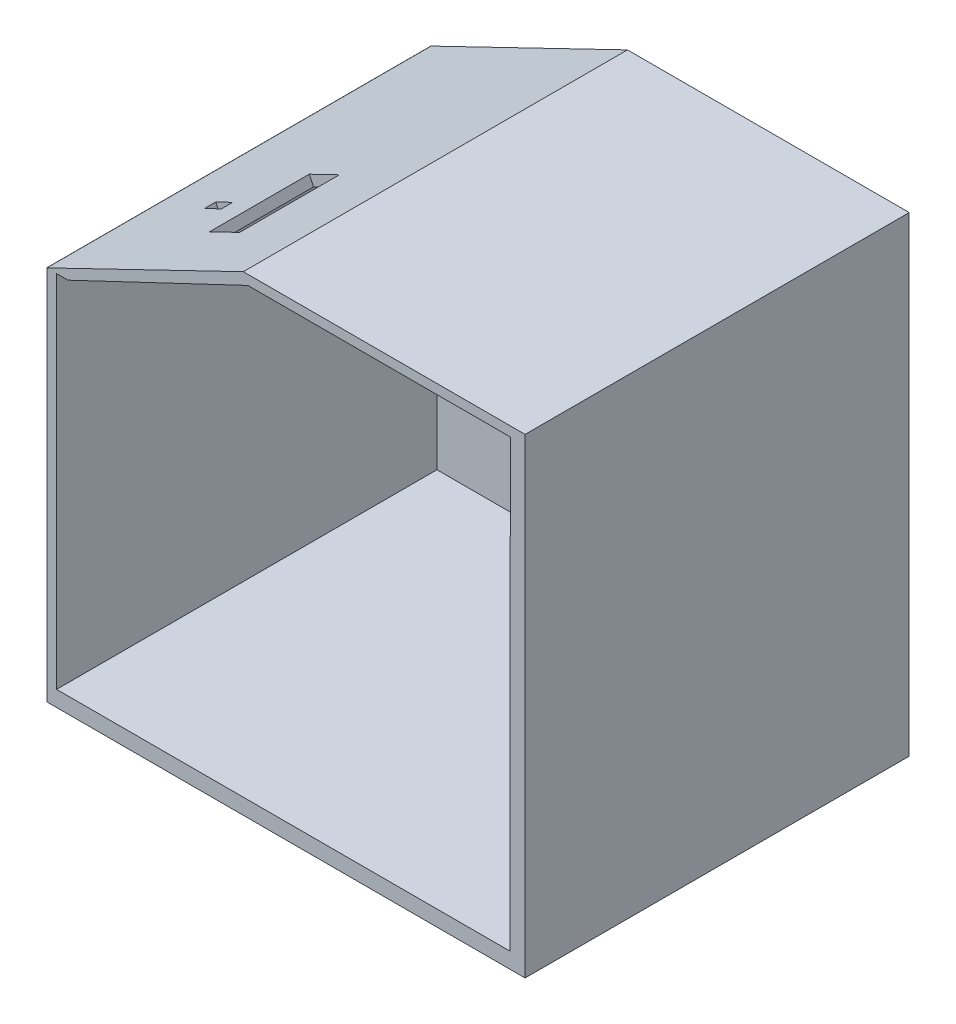
ISO-10303-21;
HEADER;
FILE_DESCRIPTION(('STEP AP214'),'2;1');
FILE_NAME('part.step','',(''),(''),'','','');
FILE_SCHEMA(('AUTOMOTIVE_DESIGN { 1 0 10303 214 1 1 1 1 }'));
ENDSEC;
DATA;
#1=APPLICATION_CONTEXT('core data for automotive mechanical design processes');
#2=APPLICATION_PROTOCOL_DEFINITION('international standard','automotive_design',2000,#1);
#3=PRODUCT_CONTEXT('',#1,'mechanical');
#4=PRODUCT('Part','Part','',(#3));
#5=PRODUCT_RELATED_PRODUCT_CATEGORY('part','',(#4));
#6=PRODUCT_DEFINITION_FORMATION('','',#4);
#7=PRODUCT_DEFINITION_CONTEXT('part definition',#1,'design');
#8=PRODUCT_DEFINITION('design','',#6,#7);
#9=PRODUCT_DEFINITION_SHAPE('','',#8);
#10=(LENGTH_UNIT() NAMED_UNIT(*) SI_UNIT(.MILLI.,.METRE.));
#11=(NAMED_UNIT(*) PLANE_ANGLE_UNIT() SI_UNIT($,.RADIAN.));
#12=(NAMED_UNIT(*) SI_UNIT($,.STERADIAN.) SOLID_ANGLE_UNIT());
#13=UNCERTAINTY_MEASURE_WITH_UNIT(LENGTH_MEASURE(1.E-05),#10,'distance_accuracy_value','');
#14=(GEOMETRIC_REPRESENTATION_CONTEXT(3) GLOBAL_UNCERTAINTY_ASSIGNED_CONTEXT((#13)) GLOBAL_UNIT_ASSIGNED_CONTEXT((#10,
#11,#12)) REPRESENTATION_CONTEXT('',''));
#15=CARTESIAN_POINT('',(0.,0.,0.));
#16=DIRECTION('',(0.,0.,1.));
#17=DIRECTION('',(1.,0.,0.));
#18=AXIS2_PLACEMENT_3D('',#15,#16,#17);
#19=CARTESIAN_POINT('',(253.882594532616,500.,204.781547842414));
#20=DIRECTION('',(0.,0.,-1.));
#21=DIRECTION('',(-1.,0.,0.));
#22=AXIS2_PLACEMENT_3D('',#19,#20,#21);
#23=PLANE('',#22);
#24=DIRECTION('',(1.,0.,0.));
#25=VECTOR('',#24,1.);
#26=CARTESIAN_POINT('',(253.882594532616,399.203948511765,204.781547842414));
#27=LINE('',#26,#25);
#28=CARTESIAN_POINT('',(-254.117405467384,399.203948511765,204.781547842414));
#29=VERTEX_POINT('',#28);
#30=CARTESIAN_POINT('',(-253.994172887688,399.203948511765,204.781547842414));
#31=VERTEX_POINT('',#30);
#32=EDGE_CURVE('E509',#29,#31,#27,.T.);
#33=ORIENTED_EDGE('',*,*,#32,.F.);
#34=DIRECTION('',(0.,-1.,0.));
#35=VECTOR('',#34,1.);
#36=CARTESIAN_POINT('',(-254.117405467384,500.,204.781547842414));
#37=LINE('',#36,#35);
#38=CARTESIAN_POINT('',(-254.117405467384,0.,204.781547842414));
#39=VERTEX_POINT('',#38);
#40=EDGE_CURVE('E464',#29,#39,#37,.T.);
#41=ORIENTED_EDGE('',*,*,#40,.T.);
#42=DIRECTION('',(1.,0.,0.));
#43=VECTOR('',#42,1.);
#44=CARTESIAN_POINT('',(253.882594532616,0.,204.781547842414));
#45=LINE('',#44,#43);
#46=CARTESIAN_POINT('',(253.882594532616,0.,204.781547842414));
#47=VERTEX_POINT('',#46);
#48=EDGE_CURVE('E440',#39,#47,#45,.T.);
#49=ORIENTED_EDGE('',*,*,#48,.T.);
#50=DIRECTION('',(0.,-1.,0.));
#51=VECTOR('',#50,1.);
#52=CARTESIAN_POINT('',(253.882594532616,500.,204.781547842414));
#53=LINE('',#52,#51);
#54=CARTESIAN_POINT('',(253.882594532616,500.,204.781547842414));
#55=VERTEX_POINT('',#54);
#56=EDGE_CURVE('E447',#55,#47,#53,.T.);
#57=ORIENTED_EDGE('',*,*,#56,.F.);
#58=DIRECTION('',(1.,0.,0.));
#59=VECTOR('',#58,1.);
#60=CARTESIAN_POINT('',(253.882594532616,500.,204.781547842414));
#61=LINE('',#60,#59);
#62=CARTESIAN_POINT('',(-45.3903766597549,500.,204.781547842414));
#63=VERTEX_POINT('',#62);
#64=EDGE_CURVE('E444',#63,#55,#61,.T.);
#65=ORIENTED_EDGE('',*,*,#64,.F.);
#66=DIRECTION('',(-0.900398187624282,-0.435066780762342,0.));
#67=VECTOR('',#66,1.);
#68=CARTESIAN_POINT('',(197.235277684948,617.235200844444,204.781547842414));
#69=LINE('',#68,#67);
#70=EDGE_CURVE('E505',#63,#31,#69,.T.);
#71=ORIENTED_EDGE('',*,*,#70,.T.);
#72=EDGE_LOOP('',(#33,#41,#49,#57,#65,#71));
#73=FACE_BOUND('',#72,.T.);
#74=DIRECTION('',(-0.903383069003791,-0.42883450261994,0.));
#75=VECTOR('',#74,1.);
#76=CARTESIAN_POINT('',(203.693094298104,605.729236982134,204.781547842414));
#77=LINE('',#76,#75);
#78=CARTESIAN_POINT('',(-40.5878057062895,489.76948319966,204.781547842414));
#79=VERTEX_POINT('',#78);
#80=CARTESIAN_POINT('',(-231.625791255195,399.084056025647,204.781547842414));
#81=VERTEX_POINT('',#80);
#82=EDGE_CURVE('E357',#79,#81,#77,.T.);
#83=ORIENTED_EDGE('',*,*,#82,.F.);
#84=DIRECTION('',(-1.,0.,0.));
#85=VECTOR('',#84,1.);
#86=CARTESIAN_POINT('',(253.882594532616,489.76948319966,204.781547842414));
#87=LINE('',#86,#85);
#88=CARTESIAN_POINT('',(238.202409937256,489.76948319966,204.781547842414));
#89=VERTEX_POINT('',#88);
#90=EDGE_CURVE('E226',#89,#79,#87,.T.);
#91=ORIENTED_EDGE('',*,*,#90,.F.);
#92=DIRECTION('',(0.,-1.,0.));
#93=VECTOR('',#92,1.);
#94=CARTESIAN_POINT('',(238.202409937256,500.,204.781547842414));
#95=LINE('',#94,#93);
#96=CARTESIAN_POINT('',(238.202409937256,398.176984129749,204.781547842414));
#97=VERTEX_POINT('',#96);
#98=EDGE_CURVE('E513',#89,#97,#95,.T.);
#99=ORIENTED_EDGE('',*,*,#98,.T.);
#100=DIRECTION('',(-1.,0.,0.));
#101=VECTOR('',#100,1.);
#102=CARTESIAN_POINT('',(253.882594532616,398.176984129749,204.781547842414));
#103=LINE('',#102,#101);
#104=CARTESIAN_POINT('',(238.104414358673,398.176984129749,204.781547842414));
#105=VERTEX_POINT('',#104);
#106=EDGE_CURVE('E339',#97,#105,#103,.T.);
#107=ORIENTED_EDGE('',*,*,#106,.T.);
#108=DIRECTION('',(0.,-1.,0.));
#109=VECTOR('',#108,1.);
#110=CARTESIAN_POINT('',(238.104414358673,500.,204.781547842414));
#111=LINE('',#110,#109);
#112=CARTESIAN_POINT('',(238.104414358674,16.6737443865783,204.781547842414));
#113=VERTEX_POINT('',#112);
#114=EDGE_CURVE('E494',#105,#113,#111,.T.);
#115=ORIENTED_EDGE('',*,*,#114,.T.);
#116=DIRECTION('',(-1.,0.,0.));
#117=VECTOR('',#116,1.);
#118=CARTESIAN_POINT('',(253.882594532616,16.6737443865783,204.781547842414));
#119=LINE('',#118,#117);
#120=CARTESIAN_POINT('',(-243.683157093227,16.6737443865783,204.781547842414));
#121=VERTEX_POINT('',#120);
#122=EDGE_CURVE('E490',#113,#121,#119,.T.);
#123=ORIENTED_EDGE('',*,*,#122,.T.);
#124=DIRECTION('',(0.,1.,0.));
#125=VECTOR('',#124,1.);
#126=CARTESIAN_POINT('',(-243.683157093227,500.,204.781547842414));
#127=LINE('',#126,#125);
#128=CARTESIAN_POINT('',(-243.683157093227,399.084056025647,204.781547842414));
#129=VERTEX_POINT('',#128);
#130=EDGE_CURVE('E501',#121,#129,#127,.T.);
#131=ORIENTED_EDGE('',*,*,#130,.T.);
#132=DIRECTION('',(1.,0.,0.));
#133=VECTOR('',#132,1.);
#134=CARTESIAN_POINT('',(253.882594532616,399.084056025647,204.781547842414));
#135=LINE('',#134,#133);
#136=EDGE_CURVE('E497',#129,#81,#135,.T.);
#137=ORIENTED_EDGE('',*,*,#136,.T.);
#138=EDGE_LOOP('',(#83,#91,#99,#107,#115,#123,#131,#137));
#139=FACE_BOUND('',#138,.T.);
#140=ADVANCED_FACE('F45',(#73,#139),#23,.F.);
#141=CARTESIAN_POINT('',(-243.683157093227,399.084056025647,-199.218452157586));
#142=DIRECTION('',(0.,1.,0.));
#143=DIRECTION('',(0.,0.,1.));
#144=AXIS2_PLACEMENT_3D('',#141,#142,#143);
#145=PLANE('',#144);
#146=DIRECTION('',(0.,0.,1.));
#147=VECTOR('',#146,1.);
#148=CARTESIAN_POINT('',(-231.625791255195,399.084056025647,-199.218452157586));
#149=LINE('',#148,#147);
#150=CARTESIAN_POINT('',(-231.625791255195,399.084056025647,-199.218452157586));
#151=VERTEX_POINT('',#150);
#152=EDGE_CURVE('E335',#151,#81,#149,.T.);
#153=ORIENTED_EDGE('',*,*,#152,.T.);
#154=ORIENTED_EDGE('',*,*,#136,.F.);
#155=DIRECTION('',(0.,0.,1.));
#156=VECTOR('',#155,1.);
#157=CARTESIAN_POINT('',(-243.683157093227,399.084056025647,-199.218452157586));
#158=LINE('',#157,#156);
#159=CARTESIAN_POINT('',(-243.683157093227,399.084056025647,-199.218452157586));
#160=VERTEX_POINT('',#159);
#161=EDGE_CURVE('E393',#160,#129,#158,.T.);
#162=ORIENTED_EDGE('',*,*,#161,.F.);
#163=DIRECTION('',(-1.,0.,0.));
#164=VECTOR('',#163,1.);
#165=CARTESIAN_POINT('',(-243.683157093227,399.084056025647,-199.218452157586));
#166=LINE('',#165,#164);
#167=EDGE_CURVE('E389',#151,#160,#166,.T.);
#168=ORIENTED_EDGE('',*,*,#167,.F.);
#169=EDGE_LOOP('',(#153,#154,#162,#168));
#170=FACE_BOUND('',#169,.T.);
#171=ADVANCED_FACE('F567',(#170),#145,.F.);
#172=CARTESIAN_POINT('',(253.882594532616,500.,-203.218452157586));
#173=DIRECTION('',(0.,0.,1.));
#174=DIRECTION('',(1.,0.,0.));
#175=AXIS2_PLACEMENT_3D('',#172,#173,#174);
#176=PLANE('',#175);
#177=DIRECTION('',(-1.,0.,0.));
#178=VECTOR('',#177,1.);
#179=CARTESIAN_POINT('',(253.882594532616,399.203948511765,-203.218452157586));
#180=LINE('',#179,#178);
#181=CARTESIAN_POINT('',(-253.994172887688,399.203948511765,-203.218452157586));
#182=VERTEX_POINT('',#181);
#183=CARTESIAN_POINT('',(-254.117405467384,399.203948511765,-203.218452157586));
#184=VERTEX_POINT('',#183);
#185=EDGE_CURVE('E374',#182,#184,#180,.T.);
#186=ORIENTED_EDGE('',*,*,#185,.F.);
#187=DIRECTION('',(0.900398187624282,0.435066780762342,0.));
#188=VECTOR('',#187,1.);
#189=CARTESIAN_POINT('',(197.235277684948,617.235200844444,-203.218452157586));
#190=LINE('',#189,#188);
#191=CARTESIAN_POINT('',(-45.3903766597549,500.,-203.218452157586));
#192=VERTEX_POINT('',#191);
#193=EDGE_CURVE('E364',#182,#192,#190,.T.);
#194=ORIENTED_EDGE('',*,*,#193,.T.);
#195=DIRECTION('',(-1.,0.,0.));
#196=VECTOR('',#195,1.);
#197=CARTESIAN_POINT('',(253.882594532616,500.,-203.218452157586));
#198=LINE('',#197,#196);
#199=CARTESIAN_POINT('',(253.882594532616,500.,-203.218452157586));
#200=VERTEX_POINT('',#199);
#201=EDGE_CURVE('E439',#200,#192,#198,.T.);
#202=ORIENTED_EDGE('',*,*,#201,.F.);
#203=DIRECTION('',(0.,-1.,0.));
#204=VECTOR('',#203,1.);
#205=CARTESIAN_POINT('',(253.882594532616,500.,-203.218452157586));
#206=LINE('',#205,#204);
#207=CARTESIAN_POINT('',(253.882594532616,0.,-203.218452157586));
#208=VERTEX_POINT('',#207);
#209=EDGE_CURVE('E470',#200,#208,#206,.T.);
#210=ORIENTED_EDGE('',*,*,#209,.T.);
#211=DIRECTION('',(-1.,0.,0.));
#212=VECTOR('',#211,1.);
#213=CARTESIAN_POINT('',(253.882594532616,0.,-203.218452157586));
#214=LINE('',#213,#212);
#215=CARTESIAN_POINT('',(-254.117405467384,0.,-203.218452157586));
#216=VERTEX_POINT('',#215);
#217=EDGE_CURVE('E451',#208,#216,#214,.T.);
#218=ORIENTED_EDGE('',*,*,#217,.T.);
#219=DIRECTION('',(0.,-1.,0.));
#220=VECTOR('',#219,1.);
#221=CARTESIAN_POINT('',(-254.117405467384,500.,-203.218452157586));
#222=LINE('',#221,#220);
#223=EDGE_CURVE('E467',#184,#216,#222,.T.);
#224=ORIENTED_EDGE('',*,*,#223,.F.);
#225=EDGE_LOOP('',(#186,#194,#202,#210,#218,#224));
#226=FACE_BOUND('',#225,.T.);
#227=ADVANCED_FACE('F547',(#226),#176,.F.);
#228=CARTESIAN_POINT('',(-254.117405467384,500.,-203.218452157586));
#229=DIRECTION('',(1.,0.,0.));
#230=DIRECTION('',(0.,0.,-1.));
#231=AXIS2_PLACEMENT_3D('',#228,#229,#230);
#232=PLANE('',#231);
#233=DIRECTION('',(0.,0.,1.));
#234=VECTOR('',#233,1.);
#235=CARTESIAN_POINT('',(-254.117405467384,324.953187265436,-203.218452157586));
#236=LINE('',#235,#234);
#237=CARTESIAN_POINT('',(-254.117405467384,324.953187265436,24.7125635276432));
#238=VERTEX_POINT('',#237);
#239=CARTESIAN_POINT('',(-254.117405467384,324.953187265436,144.712563527643));
#240=VERTEX_POINT('',#239);
#241=EDGE_CURVE('E474',#238,#240,#236,.T.);
#242=ORIENTED_EDGE('',*,*,#241,.T.);
#243=DIRECTION('',(0.,-1.,0.));
#244=VECTOR('',#243,1.);
#245=CARTESIAN_POINT('',(-254.117405467384,500.,144.712563527643));
#246=LINE('',#245,#244);
#247=CARTESIAN_POINT('',(-254.117405467384,144.953187265436,144.712563527643));
#248=VERTEX_POINT('',#247);
#249=EDGE_CURVE('E486',#240,#248,#246,.T.);
#250=ORIENTED_EDGE('',*,*,#249,.T.);
#251=DIRECTION('',(0.,0.,-1.));
#252=VECTOR('',#251,1.);
#253=CARTESIAN_POINT('',(-254.117405467384,144.953187265436,-203.218452157586));
#254=LINE('',#253,#252);
#255=CARTESIAN_POINT('',(-254.117405467384,144.953187265436,24.7125635276432));
#256=VERTEX_POINT('',#255);
#257=EDGE_CURVE('E482',#248,#256,#254,.T.);
#258=ORIENTED_EDGE('',*,*,#257,.T.);
#259=DIRECTION('',(0.,1.,0.));
#260=VECTOR('',#259,1.);
#261=CARTESIAN_POINT('',(-254.117405467384,500.,24.7125635276432));
#262=LINE('',#261,#260);
#263=EDGE_CURVE('E478',#256,#238,#262,.T.);
#264=ORIENTED_EDGE('',*,*,#263,.T.);
#265=EDGE_LOOP('',(#242,#250,#258,#264));
#266=FACE_BOUND('',#265,.T.);
#267=DIRECTION('',(0.,0.,1.));
#268=VECTOR('',#267,1.);
#269=CARTESIAN_POINT('',(-254.117405467384,399.203948511765,-229.218452157586));
#270=LINE('',#269,#268);
#271=EDGE_CURVE('E361',#184,#29,#270,.T.);
#272=ORIENTED_EDGE('',*,*,#271,.F.);
#273=ORIENTED_EDGE('',*,*,#223,.T.);
#274=DIRECTION('',(0.,0.,1.));
#275=VECTOR('',#274,1.);
#276=CARTESIAN_POINT('',(-254.117405467384,0.,-203.218452157586));
#277=LINE('',#276,#275);
#278=EDGE_CURVE('E455',#216,#39,#277,.T.);
#279=ORIENTED_EDGE('',*,*,#278,.T.);
#280=ORIENTED_EDGE('',*,*,#40,.F.);
#281=EDGE_LOOP('',(#272,#273,#279,#280));
#282=FACE_BOUND('',#281,.T.);
#283=ADVANCED_FACE('F550',(#266,#282),#232,.F.);
#284=CARTESIAN_POINT('',(0.,500.,0.));
#285=DIRECTION('',(0.,-1.,0.));
#286=DIRECTION('',(0.,0.,-1.));
#287=AXIS2_PLACEMENT_3D('',#284,#285,#286);
#288=PLANE('',#287);
#289=ORIENTED_EDGE('',*,*,#201,.T.);
#290=DIRECTION('',(0.,0.,1.));
#291=VECTOR('',#290,1.);
#292=CARTESIAN_POINT('',(-45.3903766597549,500.,-229.218452157586));
#293=LINE('',#292,#291);
#294=EDGE_CURVE('E365',#192,#63,#293,.T.);
#295=ORIENTED_EDGE('',*,*,#294,.T.);
#296=ORIENTED_EDGE('',*,*,#64,.T.);
#297=DIRECTION('',(0.,0.,-1.));
#298=VECTOR('',#297,1.);
#299=CARTESIAN_POINT('',(253.882594532616,500.,-203.218452157586));
#300=LINE('',#299,#298);
#301=EDGE_CURVE('E435',#55,#200,#300,.T.);
#302=ORIENTED_EDGE('',*,*,#301,.T.);
#303=EDGE_LOOP('',(#289,#295,#296,#302));
#304=FACE_BOUND('',#303,.T.);
#305=ADVANCED_FACE('F544',(#304),#288,.F.);
#306=CARTESIAN_POINT('',(0.,0.,0.));
#307=DIRECTION('',(0.,-1.,0.));
#308=DIRECTION('',(0.,0.,-1.));
#309=AXIS2_PLACEMENT_3D('',#306,#307,#308);
#310=PLANE('',#309);
#311=DIRECTION('',(0.,0.,-1.));
#312=VECTOR('',#311,1.);
#313=CARTESIAN_POINT('',(253.882594532616,0.,-203.218452157586));
#314=LINE('',#313,#312);
#315=EDGE_CURVE('E424',#47,#208,#314,.T.);
#316=ORIENTED_EDGE('',*,*,#315,.F.);
#317=ORIENTED_EDGE('',*,*,#48,.F.);
#318=ORIENTED_EDGE('',*,*,#278,.F.);
#319=ORIENTED_EDGE('',*,*,#217,.F.);
#320=EDGE_LOOP('',(#316,#317,#318,#319));
#321=FACE_BOUND('',#320,.T.);
#322=ADVANCED_FACE('F556',(#321),#310,.T.);
#323=CARTESIAN_POINT('',(253.882594532616,500.,-203.218452157586));
#324=DIRECTION('',(-1.,0.,0.));
#325=DIRECTION('',(0.,0.,1.));
#326=AXIS2_PLACEMENT_3D('',#323,#324,#325);
#327=PLANE('',#326);
#328=ORIENTED_EDGE('',*,*,#315,.T.);
#329=ORIENTED_EDGE('',*,*,#209,.F.);
#330=ORIENTED_EDGE('',*,*,#301,.F.);
#331=ORIENTED_EDGE('',*,*,#56,.T.);
#332=EDGE_LOOP('',(#328,#329,#330,#331));
#333=FACE_BOUND('',#332,.T.);
#334=ADVANCED_FACE('F47',(#333),#327,.F.);
#335=CARTESIAN_POINT('',(-246.617405467384,324.953187265436,144.712563527643));
#336=DIRECTION('',(0.,0.,1.));
#337=DIRECTION('',(1.,0.,0.));
#338=AXIS2_PLACEMENT_3D('',#335,#336,#337);
#339=PLANE('',#338);
#340=DIRECTION('',(-1.,0.,0.));
#341=VECTOR('',#340,1.);
#342=CARTESIAN_POINT('',(-246.617405467384,324.953187265436,144.712563527643));
#343=LINE('',#342,#341);
#344=CARTESIAN_POINT('',(-246.617405467384,324.953187265436,144.712563527643));
#345=VERTEX_POINT('',#344);
#346=EDGE_CURVE('E419',#345,#240,#343,.T.);
#347=ORIENTED_EDGE('',*,*,#346,.F.);
#348=DIRECTION('',(0.,1.,0.));
#349=VECTOR('',#348,1.);
#350=CARTESIAN_POINT('',(-246.617405467384,324.953187265436,144.712563527643));
#351=LINE('',#350,#349);
#352=CARTESIAN_POINT('',(-246.617405467384,144.953187265436,144.712563527643));
#353=VERTEX_POINT('',#352);
#354=EDGE_CURVE('E397',#353,#345,#351,.T.);
#355=ORIENTED_EDGE('',*,*,#354,.F.);
#356=DIRECTION('',(-1.,0.,0.));
#357=VECTOR('',#356,1.);
#358=CARTESIAN_POINT('',(-246.617405467384,144.953187265436,144.712563527643));
#359=LINE('',#358,#357);
#360=EDGE_CURVE('E420',#353,#248,#359,.T.);
#361=ORIENTED_EDGE('',*,*,#360,.T.);
#362=ORIENTED_EDGE('',*,*,#249,.F.);
#363=EDGE_LOOP('',(#347,#355,#361,#362));
#364=FACE_BOUND('',#363,.T.);
#365=ADVANCED_FACE('F563',(#364),#339,.F.);
#366=CARTESIAN_POINT('',(-246.617405467384,144.953187265436,144.712563527643));
#367=DIRECTION('',(0.,-1.,0.));
#368=DIRECTION('',(0.,0.,-1.));
#369=AXIS2_PLACEMENT_3D('',#366,#367,#368);
#370=PLANE('',#369);
#371=ORIENTED_EDGE('',*,*,#360,.F.);
#372=DIRECTION('',(0.,0.,1.));
#373=VECTOR('',#372,1.);
#374=CARTESIAN_POINT('',(-246.617405467384,144.953187265436,144.712563527643));
#375=LINE('',#374,#373);
#376=CARTESIAN_POINT('',(-246.617405467384,144.953187265436,24.7125635276432));
#377=VERTEX_POINT('',#376);
#378=EDGE_CURVE('E415',#377,#353,#375,.T.);
#379=ORIENTED_EDGE('',*,*,#378,.F.);
#380=DIRECTION('',(-1.,0.,0.));
#381=VECTOR('',#380,1.);
#382=CARTESIAN_POINT('',(-246.617405467384,144.953187265436,24.7125635276432));
#383=LINE('',#382,#381);
#384=EDGE_CURVE('E425',#377,#256,#383,.T.);
#385=ORIENTED_EDGE('',*,*,#384,.T.);
#386=ORIENTED_EDGE('',*,*,#257,.F.);
#387=EDGE_LOOP('',(#371,#379,#385,#386));
#388=FACE_BOUND('',#387,.T.);
#389=ADVANCED_FACE('F756',(#388),#370,.F.);
#390=CARTESIAN_POINT('',(-246.617405467384,324.953187265436,24.7125635276432));
#391=DIRECTION('',(0.,0.,-1.));
#392=DIRECTION('',(-1.,0.,0.));
#393=AXIS2_PLACEMENT_3D('',#390,#391,#392);
#394=PLANE('',#393);
#395=ORIENTED_EDGE('',*,*,#384,.F.);
#396=DIRECTION('',(0.,-1.,0.));
#397=VECTOR('',#396,1.);
#398=CARTESIAN_POINT('',(-246.617405467384,324.953187265436,24.7125635276432));
#399=LINE('',#398,#397);
#400=CARTESIAN_POINT('',(-246.617405467384,324.953187265436,24.7125635276432));
#401=VERTEX_POINT('',#400);
#402=EDGE_CURVE('E411',#401,#377,#399,.T.);
#403=ORIENTED_EDGE('',*,*,#402,.F.);
#404=DIRECTION('',(-1.,0.,0.));
#405=VECTOR('',#404,1.);
#406=CARTESIAN_POINT('',(-246.617405467384,324.953187265436,24.7125635276432));
#407=LINE('',#406,#405);
#408=EDGE_CURVE('E429',#401,#238,#407,.T.);
#409=ORIENTED_EDGE('',*,*,#408,.T.);
#410=ORIENTED_EDGE('',*,*,#263,.F.);
#411=EDGE_LOOP('',(#395,#403,#409,#410));
#412=FACE_BOUND('',#411,.T.);
#413=ADVANCED_FACE('F759',(#412),#394,.F.);
#414=CARTESIAN_POINT('',(-246.617405467384,324.953187265436,144.712563527643));
#415=DIRECTION('',(0.,1.,0.));
#416=DIRECTION('',(0.,0.,1.));
#417=AXIS2_PLACEMENT_3D('',#414,#415,#416);
#418=PLANE('',#417);
#419=ORIENTED_EDGE('',*,*,#408,.F.);
#420=DIRECTION('',(0.,0.,-1.));
#421=VECTOR('',#420,1.);
#422=CARTESIAN_POINT('',(-246.617405467384,324.953187265436,144.712563527643));
#423=LINE('',#422,#421);
#424=EDGE_CURVE('E407',#345,#401,#423,.T.);
#425=ORIENTED_EDGE('',*,*,#424,.F.);
#426=ORIENTED_EDGE('',*,*,#346,.T.);
#427=ORIENTED_EDGE('',*,*,#241,.F.);
#428=EDGE_LOOP('',(#419,#425,#426,#427));
#429=FACE_BOUND('',#428,.T.);
#430=ADVANCED_FACE('F754',(#429),#418,.F.);
#431=CARTESIAN_POINT('',(-246.617405467384,0.,0.));
#432=DIRECTION('',(1.,0.,0.));
#433=DIRECTION('',(0.,0.,-1.));
#434=AXIS2_PLACEMENT_3D('',#431,#432,#433);
#435=PLANE('',#434);
#436=ORIENTED_EDGE('',*,*,#354,.T.);
#437=ORIENTED_EDGE('',*,*,#424,.T.);
#438=ORIENTED_EDGE('',*,*,#402,.T.);
#439=ORIENTED_EDGE('',*,*,#378,.T.);
#440=EDGE_LOOP('',(#436,#437,#438,#439));
#441=FACE_BOUND('',#440,.T.);
#442=ADVANCED_FACE('F750',(#441),#435,.F.);
#443=CARTESIAN_POINT('',(-243.683157093227,399.084056025647,-199.218452157586));
#444=DIRECTION('',(-1.,0.,0.));
#445=DIRECTION('',(0.,0.,1.));
#446=AXIS2_PLACEMENT_3D('',#443,#444,#445);
#447=PLANE('',#446);
#448=DIRECTION('',(0.,0.,1.));
#449=VECTOR('',#448,1.);
#450=CARTESIAN_POINT('',(-243.683157093227,16.6737443865783,-199.218452157586));
#451=LINE('',#450,#449);
#452=CARTESIAN_POINT('',(-243.683157093227,16.6737443865783,-199.218452157586));
#453=VERTEX_POINT('',#452);
#454=EDGE_CURVE('E392',#453,#121,#451,.T.);
#455=ORIENTED_EDGE('',*,*,#454,.F.);
#456=DIRECTION('',(0.,-1.,0.));
#457=VECTOR('',#456,1.);
#458=CARTESIAN_POINT('',(-243.683157093227,399.084056025647,-199.218452157586));
#459=LINE('',#458,#457);
#460=EDGE_CURVE('E377',#160,#453,#459,.T.);
#461=ORIENTED_EDGE('',*,*,#460,.F.);
#462=ORIENTED_EDGE('',*,*,#161,.T.);
#463=ORIENTED_EDGE('',*,*,#130,.F.);
#464=EDGE_LOOP('',(#455,#461,#462,#463));
#465=FACE_BOUND('',#464,.T.);
#466=ADVANCED_FACE('F623',(#465),#447,.F.);
#467=CARTESIAN_POINT('',(238.104414358673,399.084056025647,-199.218452157586));
#468=DIRECTION('',(1.,0.,0.));
#469=DIRECTION('',(0.,1.,0.));
#470=AXIS2_PLACEMENT_3D('',#467,#468,#469);
#471=PLANE('',#470);
#472=ORIENTED_EDGE('',*,*,#114,.F.);
#473=DIRECTION('',(0.,0.,1.));
#474=VECTOR('',#473,1.);
#475=CARTESIAN_POINT('',(238.104414358673,398.176984129749,-199.218452157586));
#476=LINE('',#475,#474);
#477=CARTESIAN_POINT('',(238.104414358673,398.176984129749,-199.218452157586));
#478=VERTEX_POINT('',#477);
#479=EDGE_CURVE('E334',#478,#105,#476,.T.);
#480=ORIENTED_EDGE('',*,*,#479,.F.);
#481=DIRECTION('',(0.,1.,0.));
#482=VECTOR('',#481,1.);
#483=CARTESIAN_POINT('',(238.104414358673,399.084056025647,-199.218452157586));
#484=LINE('',#483,#482);
#485=CARTESIAN_POINT('',(238.104414358674,16.6737443865783,-199.218452157586));
#486=VERTEX_POINT('',#485);
#487=EDGE_CURVE('E385',#486,#478,#484,.T.);
#488=ORIENTED_EDGE('',*,*,#487,.F.);
#489=DIRECTION('',(0.,0.,1.));
#490=VECTOR('',#489,1.);
#491=CARTESIAN_POINT('',(238.104414358674,16.6737443865783,-199.218452157586));
#492=LINE('',#491,#490);
#493=EDGE_CURVE('E398',#486,#113,#492,.T.);
#494=ORIENTED_EDGE('',*,*,#493,.T.);
#495=EDGE_LOOP('',(#472,#480,#488,#494));
#496=FACE_BOUND('',#495,.T.);
#497=ADVANCED_FACE('F617',(#496),#471,.F.);
#498=CARTESIAN_POINT('',(-243.683157093227,16.6737443865783,-199.218452157586));
#499=DIRECTION('',(0.,-1.,0.));
#500=DIRECTION('',(0.,0.,-1.));
#501=AXIS2_PLACEMENT_3D('',#498,#499,#500);
#502=PLANE('',#501);
#503=ORIENTED_EDGE('',*,*,#493,.F.);
#504=DIRECTION('',(1.,0.,0.));
#505=VECTOR('',#504,1.);
#506=CARTESIAN_POINT('',(-243.683157093227,16.6737443865783,-199.218452157586));
#507=LINE('',#506,#505);
#508=EDGE_CURVE('E381',#453,#486,#507,.T.);
#509=ORIENTED_EDGE('',*,*,#508,.F.);
#510=ORIENTED_EDGE('',*,*,#454,.T.);
#511=ORIENTED_EDGE('',*,*,#122,.F.);
#512=EDGE_LOOP('',(#503,#509,#510,#511));
#513=FACE_BOUND('',#512,.T.);
#514=ADVANCED_FACE('F622',(#513),#502,.F.);
#515=CARTESIAN_POINT('',(0.,0.,-199.218452157586));
#516=DIRECTION('',(0.,0.,1.));
#517=DIRECTION('',(1.,0.,0.));
#518=AXIS2_PLACEMENT_3D('',#515,#516,#517);
#519=PLANE('',#518);
#520=ORIENTED_EDGE('',*,*,#487,.T.);
#521=DIRECTION('',(1.,0.,0.));
#522=VECTOR('',#521,1.);
#523=CARTESIAN_POINT('',(0.,398.176984129749,-199.218452157586));
#524=LINE('',#523,#522);
#525=CARTESIAN_POINT('',(238.202409937256,398.176984129749,-199.218452157586));
#526=VERTEX_POINT('',#525);
#527=EDGE_CURVE('E320',#478,#526,#524,.T.);
#528=ORIENTED_EDGE('',*,*,#527,.T.);
#529=DIRECTION('',(0.,1.,0.));
#530=VECTOR('',#529,1.);
#531=CARTESIAN_POINT('',(238.202409937256,0.,-199.218452157586));
#532=LINE('',#531,#530);
#533=CARTESIAN_POINT('',(238.202409937256,489.76948319966,-199.218452157586));
#534=VERTEX_POINT('',#533);
#535=EDGE_CURVE('E324',#526,#534,#532,.T.);
#536=ORIENTED_EDGE('',*,*,#535,.T.);
#537=DIRECTION('',(1.,0.,0.));
#538=VECTOR('',#537,1.);
#539=CARTESIAN_POINT('',(0.,489.76948319966,-199.218452157586));
#540=LINE('',#539,#538);
#541=CARTESIAN_POINT('',(-40.5878057062895,489.76948319966,-199.218452157586));
#542=VERTEX_POINT('',#541);
#543=EDGE_CURVE('E328',#542,#534,#540,.T.);
#544=ORIENTED_EDGE('',*,*,#543,.F.);
#545=DIRECTION('',(0.903383069003792,0.42883450261994,0.));
#546=VECTOR('',#545,1.);
#547=CARTESIAN_POINT('',(-197.201651740041,415.425140172131,-199.218452157586));
#548=LINE('',#547,#546);
#549=EDGE_CURVE('E331',#151,#542,#548,.T.);
#550=ORIENTED_EDGE('',*,*,#549,.F.);
#551=ORIENTED_EDGE('',*,*,#167,.T.);
#552=ORIENTED_EDGE('',*,*,#460,.T.);
#553=ORIENTED_EDGE('',*,*,#508,.T.);
#554=EDGE_LOOP('',(#520,#528,#536,#544,#550,#551,#552,#553));
#555=FACE_BOUND('',#554,.T.);
#556=ADVANCED_FACE('F600',(#555),#519,.T.);
#557=CARTESIAN_POINT('',(0.,399.203948511765,-229.218452157586));
#558=DIRECTION('',(0.,1.,0.));
#559=DIRECTION('',(0.,0.,1.));
#560=AXIS2_PLACEMENT_3D('',#557,#558,#559);
#561=PLANE('',#560);
#562=ORIENTED_EDGE('',*,*,#185,.T.);
#563=ORIENTED_EDGE('',*,*,#271,.T.);
#564=ORIENTED_EDGE('',*,*,#32,.T.);
#565=DIRECTION('',(0.,0.,1.));
#566=VECTOR('',#565,1.);
#567=CARTESIAN_POINT('',(-253.994172887688,399.203948511765,-229.218452157586));
#568=LINE('',#567,#566);
#569=EDGE_CURVE('E360',#182,#31,#568,.T.);
#570=ORIENTED_EDGE('',*,*,#569,.F.);
#571=EDGE_LOOP('',(#562,#563,#564,#570));
#572=FACE_BOUND('',#571,.T.);
#573=ADVANCED_FACE('F529',(#572),#561,.T.);
#574=CARTESIAN_POINT('',(-204.458301820282,423.139372031906,-229.218452157586));
#575=DIRECTION('',(0.435066780762342,-0.900398187624282,0.));
#576=DIRECTION('',(0.900398187624282,0.435066780762342,0.));
#577=AXIS2_PLACEMENT_3D('',#574,#575,#576);
#578=PLANE('',#577);
#579=DIRECTION('',(-0.900398187624282,-0.435066780762342,0.));
#580=VECTOR('',#579,1.);
#581=CARTESIAN_POINT('',(-204.458301820282,423.139372031906,93.7553776624558));
#582=LINE('',#581,#580);
#583=CARTESIAN_POINT('',(-179.713417500537,435.09594558936,93.7553776624558));
#584=VERTEX_POINT('',#583);
#585=CARTESIAN_POINT('',(-197.721381253023,426.394609974114,93.7553776624558));
#586=VERTEX_POINT('',#585);
#587=EDGE_CURVE('E310',#584,#586,#582,.T.);
#588=ORIENTED_EDGE('',*,*,#587,.T.);
#589=DIRECTION('',(0.,0.,-1.));
#590=VECTOR('',#589,1.);
#591=CARTESIAN_POINT('',(-197.721381253023,426.394609974114,-229.218452157586));
#592=LINE('',#591,#590);
#593=CARTESIAN_POINT('',(-197.721381253023,426.394609974114,81.7553776624558));
#594=VERTEX_POINT('',#593);
#595=EDGE_CURVE('E281',#586,#594,#592,.T.);
#596=ORIENTED_EDGE('',*,*,#595,.T.);
#597=DIRECTION('',(0.900398187624282,0.435066780762342,0.));
#598=VECTOR('',#597,1.);
#599=CARTESIAN_POINT('',(-204.458301820282,423.139372031906,81.7553776624558));
#600=LINE('',#599,#598);
#601=CARTESIAN_POINT('',(-179.713417500537,435.09594558936,81.7553776624558));
#602=VERTEX_POINT('',#601);
#603=EDGE_CURVE('E315',#594,#602,#600,.T.);
#604=ORIENTED_EDGE('',*,*,#603,.T.);
#605=DIRECTION('',(0.,0.,1.));
#606=VECTOR('',#605,1.);
#607=CARTESIAN_POINT('',(-179.713417500537,435.09594558936,-229.218452157586));
#608=LINE('',#607,#606);
#609=EDGE_CURVE('E273',#602,#584,#608,.T.);
#610=ORIENTED_EDGE('',*,*,#609,.T.);
#611=EDGE_LOOP('',(#588,#596,#604,#610));
#612=FACE_BOUND('',#611,.T.);
#613=DIRECTION('',(-0.900398187624282,-0.435066780762342,0.));
#614=VECTOR('',#613,1.);
#615=CARTESIAN_POINT('',(-204.458301820282,423.139372031906,135.022659023902));
#616=LINE('',#615,#614);
#617=CARTESIAN_POINT('',(-119.140884946462,464.364215009645,135.022659023902));
#618=VERTEX_POINT('',#617);
#619=CARTESIAN_POINT('',(-151.105020607124,448.919344292582,135.022659023902));
#620=VERTEX_POINT('',#619);
#621=EDGE_CURVE('E297',#618,#620,#616,.T.);
#622=ORIENTED_EDGE('',*,*,#621,.T.);
#623=DIRECTION('',(0.,0.,-1.));
#624=VECTOR('',#623,1.);
#625=CARTESIAN_POINT('',(-151.105020607124,448.919344292582,-229.218452157586));
#626=LINE('',#625,#624);
#627=CARTESIAN_POINT('',(-151.105020607124,448.919344292582,29.0226590239022));
#628=VERTEX_POINT('',#627);
#629=EDGE_CURVE('E234',#620,#628,#626,.T.);
#630=ORIENTED_EDGE('',*,*,#629,.T.);
#631=DIRECTION('',(0.900398187624282,0.435066780762342,0.));
#632=VECTOR('',#631,1.);
#633=CARTESIAN_POINT('',(-204.458301820282,423.139372031906,29.0226590239022));
#634=LINE('',#633,#632);
#635=CARTESIAN_POINT('',(-119.140884946462,464.364215009645,29.0226590239022));
#636=VERTEX_POINT('',#635);
#637=EDGE_CURVE('E304',#628,#636,#634,.T.);
#638=ORIENTED_EDGE('',*,*,#637,.T.);
#639=DIRECTION('',(0.,0.,1.));
#640=VECTOR('',#639,1.);
#641=CARTESIAN_POINT('',(-119.140884946462,464.364215009645,-229.218452157586));
#642=LINE('',#641,#640);
#643=EDGE_CURVE('E300',#636,#618,#642,.T.);
#644=ORIENTED_EDGE('',*,*,#643,.T.);
#645=EDGE_LOOP('',(#622,#630,#638,#644));
#646=FACE_BOUND('',#645,.T.);
#647=ORIENTED_EDGE('',*,*,#569,.T.);
#648=ORIENTED_EDGE('',*,*,#70,.F.);
#649=ORIENTED_EDGE('',*,*,#294,.F.);
#650=ORIENTED_EDGE('',*,*,#193,.F.);
#651=EDGE_LOOP('',(#647,#648,#649,#650));
#652=FACE_BOUND('',#651,.T.);
#653=ADVANCED_FACE('F525',(#612,#646,#652),#578,.F.);
#654=CARTESIAN_POINT('',(0.,489.76948319966,-199.218452157586));
#655=DIRECTION('',(0.,-1.,0.));
#656=DIRECTION('',(0.,0.,-1.));
#657=AXIS2_PLACEMENT_3D('',#654,#655,#656);
#658=PLANE('',#657);
#659=ORIENTED_EDGE('',*,*,#90,.T.);
#660=DIRECTION('',(0.,0.,1.));
#661=VECTOR('',#660,1.);
#662=CARTESIAN_POINT('',(-40.5878057062895,489.76948319966,-199.218452157586));
#663=LINE('',#662,#661);
#664=EDGE_CURVE('E340',#542,#79,#663,.T.);
#665=ORIENTED_EDGE('',*,*,#664,.F.);
#666=ORIENTED_EDGE('',*,*,#543,.T.);
#667=DIRECTION('',(0.,0.,1.));
#668=VECTOR('',#667,1.);
#669=CARTESIAN_POINT('',(238.202409937256,489.76948319966,-199.218452157586));
#670=LINE('',#669,#668);
#671=EDGE_CURVE('E344',#534,#89,#670,.T.);
#672=ORIENTED_EDGE('',*,*,#671,.T.);
#673=EDGE_LOOP('',(#659,#665,#666,#672));
#674=FACE_BOUND('',#673,.T.);
#675=ADVANCED_FACE('F528',(#674),#658,.T.);
#676=CARTESIAN_POINT('',(238.202409937256,0.,-199.218452157586));
#677=DIRECTION('',(1.,0.,0.));
#678=DIRECTION('',(0.,0.,-1.));
#679=AXIS2_PLACEMENT_3D('',#676,#677,#678);
#680=PLANE('',#679);
#681=ORIENTED_EDGE('',*,*,#671,.F.);
#682=ORIENTED_EDGE('',*,*,#535,.F.);
#683=DIRECTION('',(0.,0.,1.));
#684=VECTOR('',#683,1.);
#685=CARTESIAN_POINT('',(238.202409937256,398.176984129749,-199.218452157586));
#686=LINE('',#685,#684);
#687=EDGE_CURVE('E348',#526,#97,#686,.T.);
#688=ORIENTED_EDGE('',*,*,#687,.T.);
#689=ORIENTED_EDGE('',*,*,#98,.F.);
#690=EDGE_LOOP('',(#681,#682,#688,#689));
#691=FACE_BOUND('',#690,.T.);
#692=ADVANCED_FACE('F645',(#691),#680,.F.);
#693=CARTESIAN_POINT('',(-197.201651740041,415.425140172131,-199.218452157586));
#694=DIRECTION('',(0.42883450261994,-0.903383069003791,0.));
#695=DIRECTION('',(0.903383069003791,0.42883450261994,0.));
#696=AXIS2_PLACEMENT_3D('',#693,#694,#695);
#697=PLANE('',#696);
#698=DIRECTION('',(0.,0.,-1.));
#699=VECTOR('',#698,1.);
#700=CARTESIAN_POINT('',(-193.312956952906,417.271097387957,-199.218452157586));
#701=LINE('',#700,#699);
#702=CARTESIAN_POINT('',(-193.312956952906,417.271097387957,93.7553776624558));
#703=VERTEX_POINT('',#702);
#704=CARTESIAN_POINT('',(-193.312956952906,417.271097387957,81.7553776624558));
#705=VERTEX_POINT('',#704);
#706=EDGE_CURVE('E12',#703,#705,#701,.T.);
#707=ORIENTED_EDGE('',*,*,#706,.F.);
#708=DIRECTION('',(-0.903383069003792,-0.42883450261994,0.));
#709=VECTOR('',#708,1.);
#710=CARTESIAN_POINT('',(-197.201651740041,415.425140172131,93.7553776624558));
#711=LINE('',#710,#709);
#712=CARTESIAN_POINT('',(-175.244864189818,425.847992217183,93.7553776624558));
#713=VERTEX_POINT('',#712);
#714=EDGE_CURVE('E243',#713,#703,#711,.T.);
#715=ORIENTED_EDGE('',*,*,#714,.F.);
#716=DIRECTION('',(0.,0.,1.));
#717=VECTOR('',#716,1.);
#718=CARTESIAN_POINT('',(-175.244864189818,425.847992217183,-199.218452157586));
#719=LINE('',#718,#717);
#720=CARTESIAN_POINT('',(-175.244864189818,425.847992217183,81.7553776624558));
#721=VERTEX_POINT('',#720);
#722=EDGE_CURVE('E247',#721,#713,#719,.T.);
#723=ORIENTED_EDGE('',*,*,#722,.F.);
#724=DIRECTION('',(0.903383069003792,0.42883450261994,0.));
#725=VECTOR('',#724,1.);
#726=CARTESIAN_POINT('',(-197.201651740041,415.425140172131,81.7553776624558));
#727=LINE('',#726,#725);
#728=EDGE_CURVE('E54',#705,#721,#727,.T.);
#729=ORIENTED_EDGE('',*,*,#728,.F.);
#730=EDGE_LOOP('',(#707,#715,#723,#729));
#731=FACE_BOUND('',#730,.T.);
#732=DIRECTION('',(0.,0.,-1.));
#733=VECTOR('',#732,1.);
#734=CARTESIAN_POINT('',(-146.540943192529,439.473697752808,-199.218452157586));
#735=LINE('',#734,#733);
#736=CARTESIAN_POINT('',(-146.540943192529,439.473697752808,135.022659023902));
#737=VERTEX_POINT('',#736);
#738=CARTESIAN_POINT('',(-146.540943192529,439.473697752808,29.0226590239022));
#739=VERTEX_POINT('',#738);
#740=EDGE_CURVE('E231',#737,#739,#735,.T.);
#741=ORIENTED_EDGE('',*,*,#740,.F.);
#742=DIRECTION('',(-0.903383069003791,-0.42883450261994,0.));
#743=VECTOR('',#742,1.);
#744=CARTESIAN_POINT('',(-197.201651740041,415.425140172131,135.022659023902));
#745=LINE('',#744,#743);
#746=CARTESIAN_POINT('',(-114.470078538049,454.697686074685,135.022659023902));
#747=VERTEX_POINT('',#746);
#748=EDGE_CURVE('E216',#747,#737,#745,.T.);
#749=ORIENTED_EDGE('',*,*,#748,.F.);
#750=DIRECTION('',(0.,0.,1.));
#751=VECTOR('',#750,1.);
#752=CARTESIAN_POINT('',(-114.470078538049,454.697686074685,-199.218452157586));
#753=LINE('',#752,#751);
#754=CARTESIAN_POINT('',(-114.470078538049,454.697686074685,29.0226590239022));
#755=VERTEX_POINT('',#754);
#756=EDGE_CURVE('E225',#755,#747,#753,.T.);
#757=ORIENTED_EDGE('',*,*,#756,.F.);
#758=DIRECTION('',(0.903383069003791,0.42883450261994,0.));
#759=VECTOR('',#758,1.);
#760=CARTESIAN_POINT('',(-197.201651740041,415.425140172131,29.0226590239022));
#761=LINE('',#760,#759);
#762=EDGE_CURVE('E241',#739,#755,#761,.T.);
#763=ORIENTED_EDGE('',*,*,#762,.F.);
#764=EDGE_LOOP('',(#741,#749,#757,#763));
#765=FACE_BOUND('',#764,.T.);
#766=ORIENTED_EDGE('',*,*,#82,.T.);
#767=ORIENTED_EDGE('',*,*,#152,.F.);
#768=ORIENTED_EDGE('',*,*,#549,.T.);
#769=ORIENTED_EDGE('',*,*,#664,.T.);
#770=EDGE_LOOP('',(#766,#767,#768,#769));
#771=FACE_BOUND('',#770,.T.);
#772=ADVANCED_FACE('F239',(#731,#765,#771),#697,.T.);
#773=CARTESIAN_POINT('',(0.,398.176984129749,-199.218452157586));
#774=DIRECTION('',(0.,-1.,0.));
#775=DIRECTION('',(0.,0.,-1.));
#776=AXIS2_PLACEMENT_3D('',#773,#774,#775);
#777=PLANE('',#776);
#778=ORIENTED_EDGE('',*,*,#687,.F.);
#779=ORIENTED_EDGE('',*,*,#527,.F.);
#780=ORIENTED_EDGE('',*,*,#479,.T.);
#781=ORIENTED_EDGE('',*,*,#106,.F.);
#782=EDGE_LOOP('',(#778,#779,#780,#781));
#783=FACE_BOUND('',#782,.T.);
#784=ADVANCED_FACE('F662',(#783),#777,.F.);
#785=CARTESIAN_POINT('',(-140.663417868828,427.309787789599,29.0226590239022));
#786=DIRECTION('',(-0.900398187624282,-0.435066780762342,0.));
#787=DIRECTION('',(0.435066780762342,-0.900398187624282,0.));
#788=AXIS2_PLACEMENT_3D('',#785,#786,#787);
#789=PLANE('',#788);
#790=DIRECTION('',(-0.435066780762342,0.900398187624282,0.));
#791=VECTOR('',#790,1.);
#792=CARTESIAN_POINT('',(-140.663417868828,427.309787789599,135.022659023902));
#793=LINE('',#792,#791);
#794=EDGE_CURVE('E69',#737,#620,#793,.T.);
#795=ORIENTED_EDGE('',*,*,#794,.F.);
#796=ORIENTED_EDGE('',*,*,#740,.T.);
#797=DIRECTION('',(-0.435066780762342,0.900398187624282,0.));
#798=VECTOR('',#797,1.);
#799=CARTESIAN_POINT('',(-140.663417868828,427.309787789599,29.0226590239022));
#800=LINE('',#799,#798);
#801=EDGE_CURVE('E284',#739,#628,#800,.T.);
#802=ORIENTED_EDGE('',*,*,#801,.T.);
#803=ORIENTED_EDGE('',*,*,#629,.F.);
#804=EDGE_LOOP('',(#795,#796,#802,#803));
#805=FACE_BOUND('',#804,.T.);
#806=ADVANCED_FACE('F229',(#805),#789,.F.);
#807=CARTESIAN_POINT('',(-140.663417868828,427.309787789599,29.0226590239022));
#808=DIRECTION('',(0.,0.,-1.));
#809=DIRECTION('',(-1.,0.,0.));
#810=AXIS2_PLACEMENT_3D('',#807,#808,#809);
#811=PLANE('',#810);
#812=ORIENTED_EDGE('',*,*,#801,.F.);
#813=ORIENTED_EDGE('',*,*,#762,.T.);
#814=DIRECTION('',(-0.435066780762342,0.900398187624282,0.));
#815=VECTOR('',#814,1.);
#816=CARTESIAN_POINT('',(-108.699282208166,442.754658506662,29.0226590239022));
#817=LINE('',#816,#815);
#818=EDGE_CURVE('E289',#755,#636,#817,.T.);
#819=ORIENTED_EDGE('',*,*,#818,.T.);
#820=ORIENTED_EDGE('',*,*,#637,.F.);
#821=EDGE_LOOP('',(#812,#813,#819,#820));
#822=FACE_BOUND('',#821,.T.);
#823=ADVANCED_FACE('F523',(#822),#811,.F.);
#824=CARTESIAN_POINT('',(-108.699282208166,442.754658506662,29.0226590239022));
#825=DIRECTION('',(0.900398187624282,0.435066780762342,0.));
#826=DIRECTION('',(-0.435066780762342,0.900398187624282,0.));
#827=AXIS2_PLACEMENT_3D('',#824,#825,#826);
#828=PLANE('',#827);
#829=ORIENTED_EDGE('',*,*,#818,.F.);
#830=ORIENTED_EDGE('',*,*,#756,.T.);
#831=DIRECTION('',(-0.435066780762342,0.900398187624282,0.));
#832=VECTOR('',#831,1.);
#833=CARTESIAN_POINT('',(-108.699282208166,442.754658506663,135.022659023902));
#834=LINE('',#833,#832);
#835=EDGE_CURVE('E219',#747,#618,#834,.T.);
#836=ORIENTED_EDGE('',*,*,#835,.T.);
#837=ORIENTED_EDGE('',*,*,#643,.F.);
#838=EDGE_LOOP('',(#829,#830,#836,#837));
#839=FACE_BOUND('',#838,.T.);
#840=ADVANCED_FACE('F521',(#839),#828,.F.);
#841=CARTESIAN_POINT('',(-140.663417868828,427.309787789599,135.022659023902));
#842=DIRECTION('',(0.,0.,1.));
#843=DIRECTION('',(1.,0.,0.));
#844=AXIS2_PLACEMENT_3D('',#841,#842,#843);
#845=PLANE('',#844);
#846=ORIENTED_EDGE('',*,*,#835,.F.);
#847=ORIENTED_EDGE('',*,*,#748,.T.);
#848=ORIENTED_EDGE('',*,*,#794,.T.);
#849=ORIENTED_EDGE('',*,*,#621,.F.);
#850=EDGE_LOOP('',(#846,#847,#848,#849));
#851=FACE_BOUND('',#850,.T.);
#852=ADVANCED_FACE('F217',(#851),#845,.F.);
#853=CARTESIAN_POINT('',(-187.279778514727,404.785053471131,81.7553776624558));
#854=DIRECTION('',(-0.900398187624282,-0.435066780762342,0.));
#855=DIRECTION('',(0.435066780762342,-0.900398187624282,0.));
#856=AXIS2_PLACEMENT_3D('',#853,#854,#855);
#857=PLANE('',#856);
#858=DIRECTION('',(-0.435066780762342,0.900398187624282,0.));
#859=VECTOR('',#858,1.);
#860=CARTESIAN_POINT('',(-187.279778514727,404.785053471131,93.7553776624558));
#861=LINE('',#860,#859);
#862=EDGE_CURVE('E61',#703,#586,#861,.T.);
#863=ORIENTED_EDGE('',*,*,#862,.F.);
#864=ORIENTED_EDGE('',*,*,#706,.T.);
#865=DIRECTION('',(-0.435066780762342,0.900398187624282,0.));
#866=VECTOR('',#865,1.);
#867=CARTESIAN_POINT('',(-187.279778514727,404.785053471131,81.7553776624558));
#868=LINE('',#867,#866);
#869=EDGE_CURVE('E264',#705,#594,#868,.T.);
#870=ORIENTED_EDGE('',*,*,#869,.T.);
#871=ORIENTED_EDGE('',*,*,#595,.F.);
#872=EDGE_LOOP('',(#863,#864,#870,#871));
#873=FACE_BOUND('',#872,.T.);
#874=ADVANCED_FACE('F279',(#873),#857,.F.);
#875=CARTESIAN_POINT('',(-187.279778514727,404.785053471131,81.7553776624558));
#876=DIRECTION('',(0.,0.,-1.));
#877=DIRECTION('',(-1.,0.,0.));
#878=AXIS2_PLACEMENT_3D('',#875,#876,#877);
#879=PLANE('',#878);
#880=ORIENTED_EDGE('',*,*,#869,.F.);
#881=ORIENTED_EDGE('',*,*,#728,.T.);
#882=DIRECTION('',(-0.435066780762342,0.900398187624282,0.));
#883=VECTOR('',#882,1.);
#884=CARTESIAN_POINT('',(-169.271814762241,413.486389086378,81.7553776624558));
#885=LINE('',#884,#883);
#886=EDGE_CURVE('E261',#721,#602,#885,.T.);
#887=ORIENTED_EDGE('',*,*,#886,.T.);
#888=ORIENTED_EDGE('',*,*,#603,.F.);
#889=EDGE_LOOP('',(#880,#881,#887,#888));
#890=FACE_BOUND('',#889,.T.);
#891=ADVANCED_FACE('F260',(#890),#879,.F.);
#892=CARTESIAN_POINT('',(-169.271814762241,413.486389086378,81.7553776624558));
#893=DIRECTION('',(0.900398187624282,0.435066780762342,0.));
#894=DIRECTION('',(-0.435066780762342,0.900398187624282,0.));
#895=AXIS2_PLACEMENT_3D('',#892,#893,#894);
#896=PLANE('',#895);
#897=ORIENTED_EDGE('',*,*,#886,.F.);
#898=ORIENTED_EDGE('',*,*,#722,.T.);
#899=DIRECTION('',(-0.435066780762342,0.900398187624282,0.));
#900=VECTOR('',#899,1.);
#901=CARTESIAN_POINT('',(-169.271814762241,413.486389086378,93.7553776624558));
#902=LINE('',#901,#900);
#903=EDGE_CURVE('E275',#713,#584,#902,.T.);
#904=ORIENTED_EDGE('',*,*,#903,.T.);
#905=ORIENTED_EDGE('',*,*,#609,.F.);
#906=EDGE_LOOP('',(#897,#898,#904,#905));
#907=FACE_BOUND('',#906,.T.);
#908=ADVANCED_FACE('F269',(#907),#896,.F.);
#909=CARTESIAN_POINT('',(-187.279778514727,404.785053471131,93.7553776624558));
#910=DIRECTION('',(0.,0.,1.));
#911=DIRECTION('',(1.,0.,0.));
#912=AXIS2_PLACEMENT_3D('',#909,#910,#911);
#913=PLANE('',#912);
#914=ORIENTED_EDGE('',*,*,#903,.F.);
#915=ORIENTED_EDGE('',*,*,#714,.T.);
#916=ORIENTED_EDGE('',*,*,#862,.T.);
#917=ORIENTED_EDGE('',*,*,#587,.F.);
#918=EDGE_LOOP('',(#914,#915,#916,#917));
#919=FACE_BOUND('',#918,.T.);
#920=ADVANCED_FACE('F277',(#919),#913,.F.);
#921=CLOSED_SHELL('',(#140,#171,#227,#283,#305,#322,#334,#365,#389,#413,#430,#442,#466,#497,
#514,#556,#573,#653,#675,#692,#772,#784,#806,#823,#840,#852,#874,#891,#908,#920));
#922=MANIFOLD_SOLID_BREP('B2',#921);
#923=ADVANCED_BREP_SHAPE_REPRESENTATION('',(#18,#922),#14);
#924=SHAPE_DEFINITION_REPRESENTATION(#9,#923);
ENDSEC;
END-ISO-10303-21;
